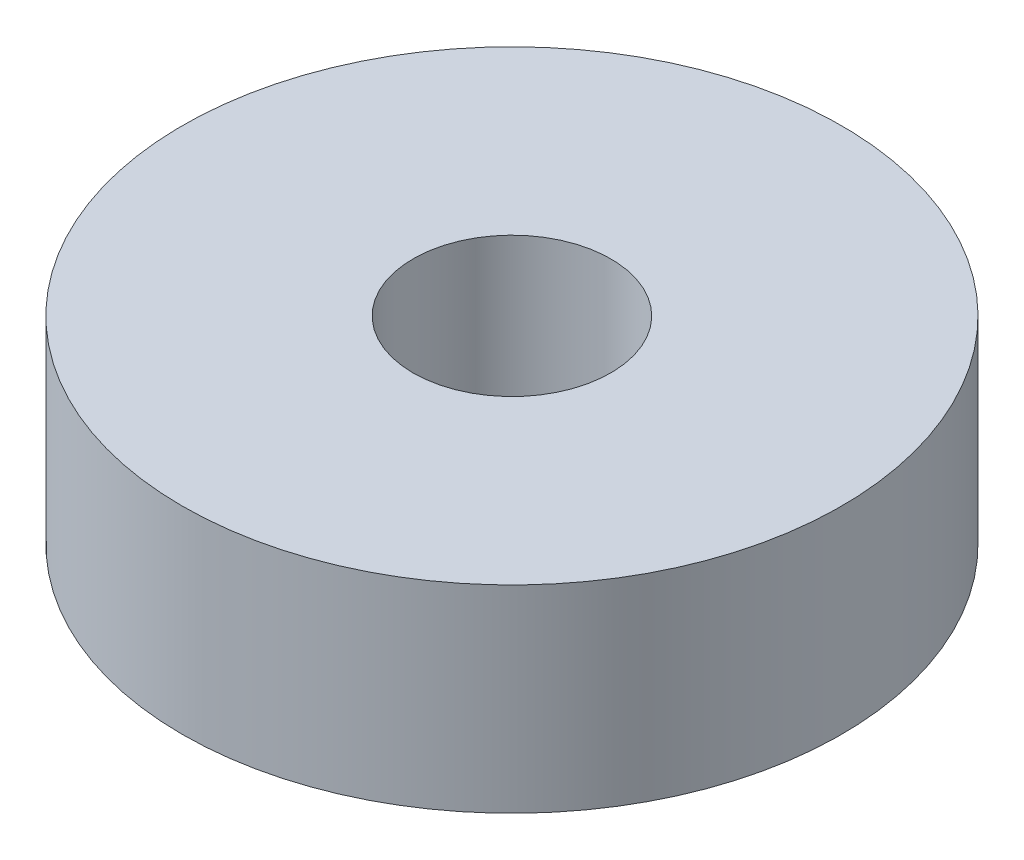
ISO-10303-21;
HEADER;
FILE_DESCRIPTION(('STEP AP214'),'2;1');
FILE_NAME('part.step','',(''),(''),'','','');
FILE_SCHEMA(('AUTOMOTIVE_DESIGN { 1 0 10303 214 1 1 1 1 }'));
ENDSEC;
DATA;
#1=APPLICATION_CONTEXT('core data for automotive mechanical design processes');
#2=APPLICATION_PROTOCOL_DEFINITION('international standard','automotive_design',2000,#1);
#3=PRODUCT_CONTEXT('',#1,'mechanical');
#4=PRODUCT('Part','Part','',(#3));
#5=PRODUCT_RELATED_PRODUCT_CATEGORY('part','',(#4));
#6=PRODUCT_DEFINITION_FORMATION('','',#4);
#7=PRODUCT_DEFINITION_CONTEXT('part definition',#1,'design');
#8=PRODUCT_DEFINITION('design','',#6,#7);
#9=PRODUCT_DEFINITION_SHAPE('','',#8);
#10=(LENGTH_UNIT() NAMED_UNIT(*) SI_UNIT(.MILLI.,.METRE.));
#11=(NAMED_UNIT(*) PLANE_ANGLE_UNIT() SI_UNIT($,.RADIAN.));
#12=(NAMED_UNIT(*) SI_UNIT($,.STERADIAN.) SOLID_ANGLE_UNIT());
#13=UNCERTAINTY_MEASURE_WITH_UNIT(LENGTH_MEASURE(1.E-05),#10,'distance_accuracy_value','');
#14=(GEOMETRIC_REPRESENTATION_CONTEXT(3) GLOBAL_UNCERTAINTY_ASSIGNED_CONTEXT((#13)) GLOBAL_UNIT_ASSIGNED_CONTEXT((#10,
#11,#12)) REPRESENTATION_CONTEXT('',''));
#15=CARTESIAN_POINT('',(0.,0.,0.));
#16=DIRECTION('',(0.,0.,1.));
#17=DIRECTION('',(1.,0.,0.));
#18=AXIS2_PLACEMENT_3D('',#15,#16,#17);
#19=CARTESIAN_POINT('',(0.,3.,0.));
#20=DIRECTION('',(0.,-1.,0.));
#21=DIRECTION('',(0.,0.,-1.));
#22=AXIS2_PLACEMENT_3D('',#19,#20,#21);
#23=CYLINDRICAL_SURFACE('',#22,5.);
#24=CARTESIAN_POINT('',(0.,3.,0.));
#25=DIRECTION('',(0.,1.,0.));
#26=DIRECTION('',(0.,0.,1.));
#27=AXIS2_PLACEMENT_3D('',#24,#25,#26);
#28=CIRCLE('',#27,5.);
#29=CARTESIAN_POINT('',(0.,3.,5.));
#30=VERTEX_POINT('',#29);
#31=EDGE_CURVE('E10',#30,#30,#28,.T.);
#32=ORIENTED_EDGE('',*,*,#31,.F.);
#33=EDGE_LOOP('',(#32));
#34=FACE_BOUND('',#33,.T.);
#35=CARTESIAN_POINT('',(0.,0.,0.));
#36=DIRECTION('',(0.,1.,0.));
#37=DIRECTION('',(0.,0.,1.));
#38=AXIS2_PLACEMENT_3D('',#35,#36,#37);
#39=CIRCLE('',#38,5.);
#40=CARTESIAN_POINT('',(0.,0.,5.));
#41=VERTEX_POINT('',#40);
#42=EDGE_CURVE('E34',#41,#41,#39,.T.);
#43=ORIENTED_EDGE('',*,*,#42,.T.);
#44=EDGE_LOOP('',(#43));
#45=FACE_BOUND('',#44,.T.);
#46=ADVANCED_FACE('F31',(#34,#45),#23,.T.);
#47=CARTESIAN_POINT('',(0.,3.,0.));
#48=DIRECTION('',(0.,1.,0.));
#49=DIRECTION('',(0.,0.,1.));
#50=AXIS2_PLACEMENT_3D('',#47,#48,#49);
#51=PLANE('',#50);
#52=CARTESIAN_POINT('',(0.,3.,0.));
#53=DIRECTION('',(0.,1.,0.));
#54=DIRECTION('',(0.,0.,1.));
#55=AXIS2_PLACEMENT_3D('',#52,#53,#54);
#56=CIRCLE('',#55,1.5);
#57=CARTESIAN_POINT('',(0.,3.,1.5));
#58=VERTEX_POINT('',#57);
#59=EDGE_CURVE('E45',#58,#58,#56,.T.);
#60=ORIENTED_EDGE('',*,*,#59,.F.);
#61=EDGE_LOOP('',(#60));
#62=FACE_BOUND('',#61,.T.);
#63=ORIENTED_EDGE('',*,*,#31,.T.);
#64=EDGE_LOOP('',(#63));
#65=FACE_BOUND('',#64,.T.);
#66=ADVANCED_FACE('F51',(#62,#65),#51,.T.);
#67=CARTESIAN_POINT('',(0.,0.,0.));
#68=DIRECTION('',(0.,1.,0.));
#69=DIRECTION('',(0.,0.,1.));
#70=AXIS2_PLACEMENT_3D('',#67,#68,#69);
#71=PLANE('',#70);
#72=CARTESIAN_POINT('',(0.,0.,0.));
#73=DIRECTION('',(0.,1.,0.));
#74=DIRECTION('',(0.,0.,1.));
#75=AXIS2_PLACEMENT_3D('',#72,#73,#74);
#76=CIRCLE('',#75,1.5);
#77=CARTESIAN_POINT('',(0.,0.,1.5));
#78=VERTEX_POINT('',#77);
#79=EDGE_CURVE('E41',#78,#78,#76,.T.);
#80=ORIENTED_EDGE('',*,*,#79,.T.);
#81=EDGE_LOOP('',(#80));
#82=FACE_BOUND('',#81,.T.);
#83=ORIENTED_EDGE('',*,*,#42,.F.);
#84=EDGE_LOOP('',(#83));
#85=FACE_BOUND('',#84,.T.);
#86=ADVANCED_FACE('F53',(#82,#85),#71,.F.);
#87=CARTESIAN_POINT('',(0.,3.,0.));
#88=DIRECTION('',(0.,1.,0.));
#89=DIRECTION('',(0.,0.,1.));
#90=AXIS2_PLACEMENT_3D('',#87,#88,#89);
#91=CYLINDRICAL_SURFACE('',#90,1.5);
#92=ORIENTED_EDGE('',*,*,#79,.F.);
#93=EDGE_LOOP('',(#92));
#94=FACE_BOUND('',#93,.T.);
#95=ORIENTED_EDGE('',*,*,#59,.T.);
#96=EDGE_LOOP('',(#95));
#97=FACE_BOUND('',#96,.T.);
#98=ADVANCED_FACE('F49',(#94,#97),#91,.F.);
#99=CLOSED_SHELL('',(#46,#66,#86,#98));
#100=MANIFOLD_SOLID_BREP('B2',#99);
#101=ADVANCED_BREP_SHAPE_REPRESENTATION('',(#18,#100),#14);
#102=SHAPE_DEFINITION_REPRESENTATION(#9,#101);
ENDSEC;
END-ISO-10303-21;
